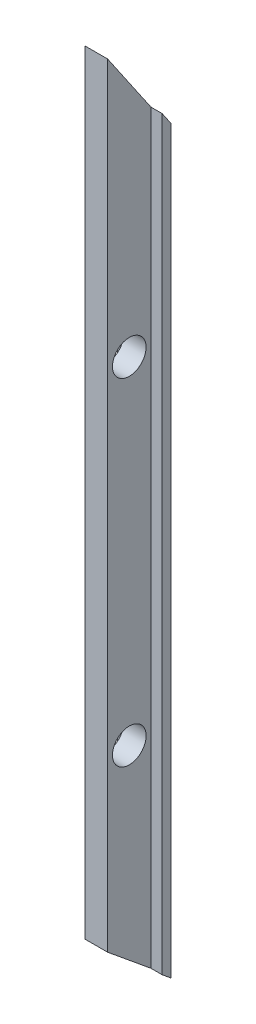
ISO-10303-21;
HEADER;
FILE_DESCRIPTION(('STEP AP214'),'2;1');
FILE_NAME('part.step','',(''),(''),'','','');
FILE_SCHEMA(('AUTOMOTIVE_DESIGN { 1 0 10303 214 1 1 1 1 }'));
ENDSEC;
DATA;
#1=APPLICATION_CONTEXT('core data for automotive mechanical design processes');
#2=APPLICATION_PROTOCOL_DEFINITION('international standard','automotive_design',2000,#1);
#3=PRODUCT_CONTEXT('',#1,'mechanical');
#4=PRODUCT('Part','Part','',(#3));
#5=PRODUCT_RELATED_PRODUCT_CATEGORY('part','',(#4));
#6=PRODUCT_DEFINITION_FORMATION('','',#4);
#7=PRODUCT_DEFINITION_CONTEXT('part definition',#1,'design');
#8=PRODUCT_DEFINITION('design','',#6,#7);
#9=PRODUCT_DEFINITION_SHAPE('','',#8);
#10=(LENGTH_UNIT() NAMED_UNIT(*) SI_UNIT(.MILLI.,.METRE.));
#11=(NAMED_UNIT(*) PLANE_ANGLE_UNIT() SI_UNIT($,.RADIAN.));
#12=(NAMED_UNIT(*) SI_UNIT($,.STERADIAN.) SOLID_ANGLE_UNIT());
#13=UNCERTAINTY_MEASURE_WITH_UNIT(LENGTH_MEASURE(1.E-05),#10,'distance_accuracy_value','');
#14=(GEOMETRIC_REPRESENTATION_CONTEXT(3) GLOBAL_UNCERTAINTY_ASSIGNED_CONTEXT((#13)) GLOBAL_UNIT_ASSIGNED_CONTEXT((#10,
#11,#12)) REPRESENTATION_CONTEXT('',''));
#15=CARTESIAN_POINT('',(0.,0.,0.));
#16=DIRECTION('',(0.,0.,1.));
#17=DIRECTION('',(1.,0.,0.));
#18=AXIS2_PLACEMENT_3D('',#15,#16,#17);
#19=CARTESIAN_POINT('',(0.,0.634730513202272,0.772733573497348));
#20=DIRECTION('',(0.,0.,-1.));
#21=DIRECTION('',(-1.,0.,0.));
#22=AXIS2_PLACEMENT_3D('',#19,#20,#21);
#23=PLANE('',#22);
#24=DIRECTION('',(0.,-1.,0.));
#25=VECTOR('',#24,1.);
#26=CARTESIAN_POINT('',(-1.,-32.3652694868031,0.772733573497348));
#27=LINE('',#26,#25);
#28=CARTESIAN_POINT('',(-1.,34.1293944186559,0.772733573497348));
#29=VERTEX_POINT('',#28);
#30=CARTESIAN_POINT('',(-1.,-32.3652694867981,0.772733573497348));
#31=VERTEX_POINT('',#30);
#32=EDGE_CURVE('E131',#29,#31,#27,.T.);
#33=ORIENTED_EDGE('',*,*,#32,.F.);
#34=DIRECTION('',(1.,0.,0.));
#35=VECTOR('',#34,1.);
#36=CARTESIAN_POINT('',(-2.00000000000003,34.1293944186559,0.772733573497345));
#37=LINE('',#36,#35);
#38=CARTESIAN_POINT('',(-2.00000000000003,34.1293944186559,0.772733573497345));
#39=VERTEX_POINT('',#38);
#40=EDGE_CURVE('E123',#39,#29,#37,.T.);
#41=ORIENTED_EDGE('',*,*,#40,.F.);
#42=DIRECTION('',(0.,-1.,0.));
#43=VECTOR('',#42,1.);
#44=CARTESIAN_POINT('',(-2.00000000000003,-32.3652694867981,0.772733573497348));
#45=LINE('',#44,#43);
#46=CARTESIAN_POINT('',(-2.00000000000003,-32.3652694867981,0.772733573497348));
#47=VERTEX_POINT('',#46);
#48=EDGE_CURVE('E150',#39,#47,#45,.T.);
#49=ORIENTED_EDGE('',*,*,#48,.T.);
#50=DIRECTION('',(1.,0.,0.));
#51=VECTOR('',#50,1.);
#52=CARTESIAN_POINT('',(-2.00000000000003,-32.3652694867981,0.772733573497348));
#53=LINE('',#52,#51);
#54=EDGE_CURVE('E62',#47,#31,#53,.T.);
#55=ORIENTED_EDGE('',*,*,#54,.T.);
#56=EDGE_LOOP('',(#33,#41,#49,#55));
#57=FACE_BOUND('',#56,.T.);
#58=ADVANCED_FACE('F38',(#57),#23,.F.);
#59=DIRECTION('',(0.,1.,0.));
#60=VECTOR('',#59,1.);
#61=CARTESIAN_POINT('',(1.,-32.3652694868031,0.772733573497348));
#62=LINE('',#61,#60);
#63=CARTESIAN_POINT('',(1.,-32.3652694867981,0.772733573497348));
#64=VERTEX_POINT('',#63);
#65=CARTESIAN_POINT('',(1.,34.1293944186559,0.772733573497348));
#66=VERTEX_POINT('',#65);
#67=EDGE_CURVE('E54',#64,#66,#62,.T.);
#68=ORIENTED_EDGE('',*,*,#67,.F.);
#69=CARTESIAN_POINT('',(1.99999999999997,-32.3652694867981,0.772733573497348));
#70=VERTEX_POINT('',#69);
#71=EDGE_CURVE('E153',#64,#70,#53,.T.);
#72=ORIENTED_EDGE('',*,*,#71,.T.);
#73=DIRECTION('',(0.,1.,0.));
#74=VECTOR('',#73,1.);
#75=CARTESIAN_POINT('',(1.99999999999997,-32.3652694867981,0.772733573497348));
#76=LINE('',#75,#74);
#77=CARTESIAN_POINT('',(1.99999999999997,34.1293944186559,0.772733573497345));
#78=VERTEX_POINT('',#77);
#79=EDGE_CURVE('E121',#70,#78,#76,.T.);
#80=ORIENTED_EDGE('',*,*,#79,.T.);
#81=EDGE_CURVE('E110',#66,#78,#37,.T.);
#82=ORIENTED_EDGE('',*,*,#81,.F.);
#83=EDGE_LOOP('',(#68,#72,#80,#82));
#84=FACE_BOUND('',#83,.T.);
#85=ADVANCED_FACE('F119',(#84),#23,.F.);
#86=CARTESIAN_POINT('',(1.99999999999997,-32.3652694867981,0.772733573497348));
#87=DIRECTION('',(-1.,0.,0.));
#88=DIRECTION('',(0.,0.,1.));
#89=AXIS2_PLACEMENT_3D('',#86,#87,#88);
#90=PLANE('',#89);
#91=DIRECTION('',(0.,-0.825310658693003,-0.564678950066072));
#92=VECTOR('',#91,1.);
#93=CARTESIAN_POINT('',(1.99999999999997,109.734509075153,52.5018810335164));
#94=LINE('',#93,#92);
#95=CARTESIAN_POINT('',(1.99999999999997,32.9999999999997,0.));
#96=VERTEX_POINT('',#95);
#97=EDGE_CURVE('E124',#78,#96,#94,.T.);
#98=ORIENTED_EDGE('',*,*,#97,.F.);
#99=ORIENTED_EDGE('',*,*,#79,.F.);
#100=DIRECTION('',(0.,-0.634730513202272,-0.772733573497348));
#101=VECTOR('',#100,1.);
#102=CARTESIAN_POINT('',(1.99999999999997,-32.3652694867981,0.772733573497348));
#103=LINE('',#102,#101);
#104=CARTESIAN_POINT('',(1.99999999999997,-33.0000000000004,0.));
#105=VERTEX_POINT('',#104);
#106=EDGE_CURVE('E47',#70,#105,#103,.T.);
#107=ORIENTED_EDGE('',*,*,#106,.T.);
#108=DIRECTION('',(0.,1.,0.));
#109=VECTOR('',#108,1.);
#110=CARTESIAN_POINT('',(1.99999999999997,-33.0000000000004,0.));
#111=LINE('',#110,#109);
#112=EDGE_CURVE('E145',#105,#96,#111,.T.);
#113=ORIENTED_EDGE('',*,*,#112,.T.);
#114=EDGE_LOOP('',(#98,#99,#107,#113));
#115=FACE_BOUND('',#114,.T.);
#116=ADVANCED_FACE('F40',(#115),#90,.F.);
#117=CARTESIAN_POINT('',(-2.00000000000003,-32.3652694867981,0.772733573497348));
#118=DIRECTION('',(1.,0.,0.));
#119=DIRECTION('',(0.,0.,-1.));
#120=AXIS2_PLACEMENT_3D('',#117,#118,#119);
#121=PLANE('',#120);
#122=DIRECTION('',(0.,-1.,0.));
#123=VECTOR('',#122,1.);
#124=CARTESIAN_POINT('',(-2.00000000000003,-33.0000000000004,0.));
#125=LINE('',#124,#123);
#126=CARTESIAN_POINT('',(-2.00000000000003,32.9999999999997,0.));
#127=VERTEX_POINT('',#126);
#128=CARTESIAN_POINT('',(-2.00000000000003,-33.0000000000004,0.));
#129=VERTEX_POINT('',#128);
#130=EDGE_CURVE('E160',#127,#129,#125,.T.);
#131=ORIENTED_EDGE('',*,*,#130,.T.);
#132=DIRECTION('',(0.,-0.634730513202272,-0.772733573497348));
#133=VECTOR('',#132,1.);
#134=CARTESIAN_POINT('',(-2.00000000000003,-32.3652694867981,0.772733573497348));
#135=LINE('',#134,#133);
#136=EDGE_CURVE('E11',#47,#129,#135,.T.);
#137=ORIENTED_EDGE('',*,*,#136,.F.);
#138=ORIENTED_EDGE('',*,*,#48,.F.);
#139=DIRECTION('',(0.,-0.825310658693003,-0.564678950066072));
#140=VECTOR('',#139,1.);
#141=CARTESIAN_POINT('',(-2.00000000000003,109.734509075153,52.5018810335164));
#142=LINE('',#141,#140);
#143=EDGE_CURVE('E142',#39,#127,#142,.T.);
#144=ORIENTED_EDGE('',*,*,#143,.T.);
#145=EDGE_LOOP('',(#131,#137,#138,#144));
#146=FACE_BOUND('',#145,.T.);
#147=ADVANCED_FACE('F173',(#146),#121,.F.);
#148=CARTESIAN_POINT('',(-2.00000000000003,-32.3652694867981,0.772733573497348));
#149=DIRECTION('',(0.,0.772733573497348,-0.634730513202272));
#150=DIRECTION('',(0.,0.634730513202272,0.772733573497348));
#151=AXIS2_PLACEMENT_3D('',#148,#149,#150);
#152=PLANE('',#151);
#153=ORIENTED_EDGE('',*,*,#71,.F.);
#154=DIRECTION('',(0.,-0.634730513202272,-0.772733573497348));
#155=VECTOR('',#154,1.);
#156=CARTESIAN_POINT('',(1.,-29.1916169207917,4.63640144098409));
#157=LINE('',#156,#155);
#158=CARTESIAN_POINT('',(1.,-29.1916169207917,4.63640144098409));
#159=VERTEX_POINT('',#158);
#160=EDGE_CURVE('E129',#159,#64,#157,.T.);
#161=ORIENTED_EDGE('',*,*,#160,.F.);
#162=DIRECTION('',(1.,0.,0.));
#163=VECTOR('',#162,1.);
#164=CARTESIAN_POINT('',(-1.,-29.1916169207917,4.63640144098409));
#165=LINE('',#164,#163);
#166=CARTESIAN_POINT('',(-1.,-29.1916169207917,4.63640144098409));
#167=VERTEX_POINT('',#166);
#168=EDGE_CURVE('E133',#167,#159,#165,.T.);
#169=ORIENTED_EDGE('',*,*,#168,.F.);
#170=DIRECTION('',(0.,-0.634730513202272,-0.772733573497348));
#171=VECTOR('',#170,1.);
#172=CARTESIAN_POINT('',(-1.,-29.1916169207917,4.63640144098409));
#173=LINE('',#172,#171);
#174=EDGE_CURVE('E140',#167,#31,#173,.T.);
#175=ORIENTED_EDGE('',*,*,#174,.T.);
#176=ORIENTED_EDGE('',*,*,#54,.F.);
#177=ORIENTED_EDGE('',*,*,#136,.T.);
#178=DIRECTION('',(1.,0.,0.));
#179=VECTOR('',#178,1.);
#180=CARTESIAN_POINT('',(-2.00000000000003,-33.0000000000004,0.));
#181=LINE('',#180,#179);
#182=EDGE_CURVE('E151',#129,#105,#181,.T.);
#183=ORIENTED_EDGE('',*,*,#182,.T.);
#184=ORIENTED_EDGE('',*,*,#106,.F.);
#185=EDGE_LOOP('',(#153,#161,#169,#175,#176,#177,#183,#184));
#186=FACE_BOUND('',#185,.T.);
#187=ADVANCED_FACE('F189',(#186),#152,.F.);
#188=CARTESIAN_POINT('',(0.,0.,0.));
#189=DIRECTION('',(0.,0.,-1.));
#190=DIRECTION('',(-1.,0.,0.));
#191=AXIS2_PLACEMENT_3D('',#188,#189,#190);
#192=PLANE('',#191);
#193=ORIENTED_EDGE('',*,*,#112,.F.);
#194=ORIENTED_EDGE('',*,*,#182,.F.);
#195=ORIENTED_EDGE('',*,*,#130,.F.);
#196=DIRECTION('',(-1.,0.,0.));
#197=VECTOR('',#196,1.);
#198=CARTESIAN_POINT('',(-2.00000000000003,32.9999999999997,0.));
#199=LINE('',#198,#197);
#200=EDGE_CURVE('E157',#96,#127,#199,.T.);
#201=ORIENTED_EDGE('',*,*,#200,.F.);
#202=EDGE_LOOP('',(#193,#194,#195,#201));
#203=FACE_BOUND('',#202,.T.);
#204=ADVANCED_FACE('F170',(#203),#192,.T.);
#205=CARTESIAN_POINT('',(-2.00000000000003,109.734509075153,52.5018810335164));
#206=DIRECTION('',(0.,-0.564678950066072,0.825310658693003));
#207=DIRECTION('',(0.,-0.825310658693003,-0.564678950066072));
#208=AXIS2_PLACEMENT_3D('',#205,#206,#207);
#209=PLANE('',#208);
#210=ORIENTED_EDGE('',*,*,#143,.F.);
#211=ORIENTED_EDGE('',*,*,#40,.T.);
#212=DIRECTION('',(0.,-0.825310658693003,-0.564678950066072));
#213=VECTOR('',#212,1.);
#214=CARTESIAN_POINT('',(-1.,115.843009648841,56.6813274687422));
#215=LINE('',#214,#213);
#216=CARTESIAN_POINT('',(-1.,39.7763665119372,4.63640144098409));
#217=VERTEX_POINT('',#216);
#218=EDGE_CURVE('E117',#217,#29,#215,.T.);
#219=ORIENTED_EDGE('',*,*,#218,.F.);
#220=DIRECTION('',(1.,0.,0.));
#221=VECTOR('',#220,1.);
#222=CARTESIAN_POINT('',(-1.,39.7763665119372,4.63640144098409));
#223=LINE('',#222,#221);
#224=CARTESIAN_POINT('',(1.,39.7763665119372,4.63640144098408));
#225=VERTEX_POINT('',#224);
#226=EDGE_CURVE('E114',#217,#225,#223,.T.);
#227=ORIENTED_EDGE('',*,*,#226,.T.);
#228=DIRECTION('',(0.,-0.825310658693003,-0.564678950066072));
#229=VECTOR('',#228,1.);
#230=CARTESIAN_POINT('',(1.,115.843009648841,56.6813274687422));
#231=LINE('',#230,#229);
#232=EDGE_CURVE('E106',#225,#66,#231,.T.);
#233=ORIENTED_EDGE('',*,*,#232,.T.);
#234=ORIENTED_EDGE('',*,*,#81,.T.);
#235=ORIENTED_EDGE('',*,*,#97,.T.);
#236=ORIENTED_EDGE('',*,*,#200,.T.);
#237=EDGE_LOOP('',(#210,#211,#219,#227,#233,#234,#235,#236));
#238=FACE_BOUND('',#237,.T.);
#239=ADVANCED_FACE('F108',(#238),#209,.F.);
#240=CARTESIAN_POINT('',(-1.,-29.1916169207917,4.63640144098409));
#241=DIRECTION('',(1.,0.,0.));
#242=DIRECTION('',(0.,0.,-1.));
#243=AXIS2_PLACEMENT_3D('',#240,#241,#242);
#244=PLANE('',#243);
#245=CARTESIAN_POINT('',(-1.,-14.1916169207917,2.70456750724072));
#246=DIRECTION('',(-1.,0.,0.));
#247=DIRECTION('',(0.,0.,1.));
#248=AXIS2_PLACEMENT_3D('',#245,#246,#247);
#249=CIRCLE('',#248,1.49999999999999);
#250=CARTESIAN_POINT('',(-1.,-14.1916169207917,4.20456750724071));
#251=VERTEX_POINT('',#250);
#252=EDGE_CURVE('E225',#251,#251,#249,.T.);
#253=ORIENTED_EDGE('',*,*,#252,.F.);
#254=EDGE_LOOP('',(#253));
#255=FACE_BOUND('',#254,.T.);
#256=CARTESIAN_POINT('',(-1.,15.8083830792083,2.70456750724072));
#257=DIRECTION('',(-1.,0.,0.));
#258=DIRECTION('',(0.,0.,1.));
#259=AXIS2_PLACEMENT_3D('',#256,#257,#258);
#260=CIRCLE('',#259,1.49999999999999);
#261=CARTESIAN_POINT('',(-1.,15.8083830792083,4.20456750724071));
#262=VERTEX_POINT('',#261);
#263=EDGE_CURVE('E181',#262,#262,#260,.T.);
#264=ORIENTED_EDGE('',*,*,#263,.F.);
#265=EDGE_LOOP('',(#264));
#266=FACE_BOUND('',#265,.T.);
#267=ORIENTED_EDGE('',*,*,#32,.T.);
#268=ORIENTED_EDGE('',*,*,#174,.F.);
#269=DIRECTION('',(0.,-1.,0.));
#270=VECTOR('',#269,1.);
#271=CARTESIAN_POINT('',(-1.,-29.1916169207917,4.63640144098409));
#272=LINE('',#271,#270);
#273=EDGE_CURVE('E130',#217,#167,#272,.T.);
#274=ORIENTED_EDGE('',*,*,#273,.F.);
#275=ORIENTED_EDGE('',*,*,#218,.T.);
#276=EDGE_LOOP('',(#267,#268,#274,#275));
#277=FACE_BOUND('',#276,.T.);
#278=ADVANCED_FACE('F177',(#255,#266,#277),#244,.F.);
#279=CARTESIAN_POINT('',(1.,-29.1916169207917,4.63640144098409));
#280=DIRECTION('',(-1.,0.,0.));
#281=DIRECTION('',(0.,0.,1.));
#282=AXIS2_PLACEMENT_3D('',#279,#280,#281);
#283=PLANE('',#282);
#284=CARTESIAN_POINT('',(1.,-14.1916169207917,2.70456750724072));
#285=DIRECTION('',(-1.,0.,0.));
#286=DIRECTION('',(0.,0.,1.));
#287=AXIS2_PLACEMENT_3D('',#284,#285,#286);
#288=CIRCLE('',#287,1.49999999999999);
#289=CARTESIAN_POINT('',(1.,-14.1916169207917,4.20456750724072));
#290=VERTEX_POINT('',#289);
#291=EDGE_CURVE('E42',#290,#290,#288,.T.);
#292=ORIENTED_EDGE('',*,*,#291,.T.);
#293=EDGE_LOOP('',(#292));
#294=FACE_BOUND('',#293,.T.);
#295=CARTESIAN_POINT('',(1.,15.8083830792083,2.70456750724072));
#296=DIRECTION('',(-1.,0.,0.));
#297=DIRECTION('',(0.,0.,1.));
#298=AXIS2_PLACEMENT_3D('',#295,#296,#297);
#299=CIRCLE('',#298,1.49999999999999);
#300=CARTESIAN_POINT('',(1.,15.8083830792083,4.20456750724071));
#301=VERTEX_POINT('',#300);
#302=EDGE_CURVE('E178',#301,#301,#299,.T.);
#303=ORIENTED_EDGE('',*,*,#302,.T.);
#304=EDGE_LOOP('',(#303));
#305=FACE_BOUND('',#304,.T.);
#306=ORIENTED_EDGE('',*,*,#232,.F.);
#307=DIRECTION('',(0.,1.,0.));
#308=VECTOR('',#307,1.);
#309=CARTESIAN_POINT('',(1.,-29.1916169207917,4.63640144098409));
#310=LINE('',#309,#308);
#311=EDGE_CURVE('E141',#159,#225,#310,.T.);
#312=ORIENTED_EDGE('',*,*,#311,.F.);
#313=ORIENTED_EDGE('',*,*,#160,.T.);
#314=ORIENTED_EDGE('',*,*,#67,.T.);
#315=EDGE_LOOP('',(#306,#312,#313,#314));
#316=FACE_BOUND('',#315,.T.);
#317=ADVANCED_FACE('F127',(#294,#305,#316),#283,.F.);
#318=CARTESIAN_POINT('',(0.,3.17365256601136,4.63640144098409));
#319=DIRECTION('',(0.,0.,-1.));
#320=DIRECTION('',(-1.,0.,0.));
#321=AXIS2_PLACEMENT_3D('',#318,#319,#320);
#322=PLANE('',#321);
#323=ORIENTED_EDGE('',*,*,#273,.T.);
#324=ORIENTED_EDGE('',*,*,#168,.T.);
#325=ORIENTED_EDGE('',*,*,#311,.T.);
#326=ORIENTED_EDGE('',*,*,#226,.F.);
#327=EDGE_LOOP('',(#323,#324,#325,#326));
#328=FACE_BOUND('',#327,.T.);
#329=ADVANCED_FACE('F187',(#328),#322,.F.);
#330=CARTESIAN_POINT('',(-1.,15.8083830792083,2.70456750724072));
#331=DIRECTION('',(-1.,0.,0.));
#332=DIRECTION('',(0.,0.,1.));
#333=AXIS2_PLACEMENT_3D('',#330,#331,#332);
#334=CYLINDRICAL_SURFACE('',#333,1.49999999999999);
#335=ORIENTED_EDGE('',*,*,#263,.T.);
#336=EDGE_LOOP('',(#335));
#337=FACE_BOUND('',#336,.T.);
#338=ORIENTED_EDGE('',*,*,#302,.F.);
#339=EDGE_LOOP('',(#338));
#340=FACE_BOUND('',#339,.T.);
#341=ADVANCED_FACE('F213',(#337,#340),#334,.F.);
#342=CARTESIAN_POINT('',(-1.,-14.1916169207917,2.70456750724072));
#343=DIRECTION('',(-1.,0.,0.));
#344=DIRECTION('',(0.,0.,1.));
#345=AXIS2_PLACEMENT_3D('',#342,#343,#344);
#346=CYLINDRICAL_SURFACE('',#345,1.49999999999999);
#347=ORIENTED_EDGE('',*,*,#252,.T.);
#348=EDGE_LOOP('',(#347));
#349=FACE_BOUND('',#348,.T.);
#350=ORIENTED_EDGE('',*,*,#291,.F.);
#351=EDGE_LOOP('',(#350));
#352=FACE_BOUND('',#351,.T.);
#353=ADVANCED_FACE('F216',(#349,#352),#346,.F.);
#354=CLOSED_SHELL('',(#58,#85,#116,#147,#187,#204,#239,#278,#317,#329,#341,#353));
#355=MANIFOLD_SOLID_BREP('B2',#354);
#356=ADVANCED_BREP_SHAPE_REPRESENTATION('',(#18,#355),#14);
#357=SHAPE_DEFINITION_REPRESENTATION(#9,#356);
ENDSEC;
END-ISO-10303-21;
